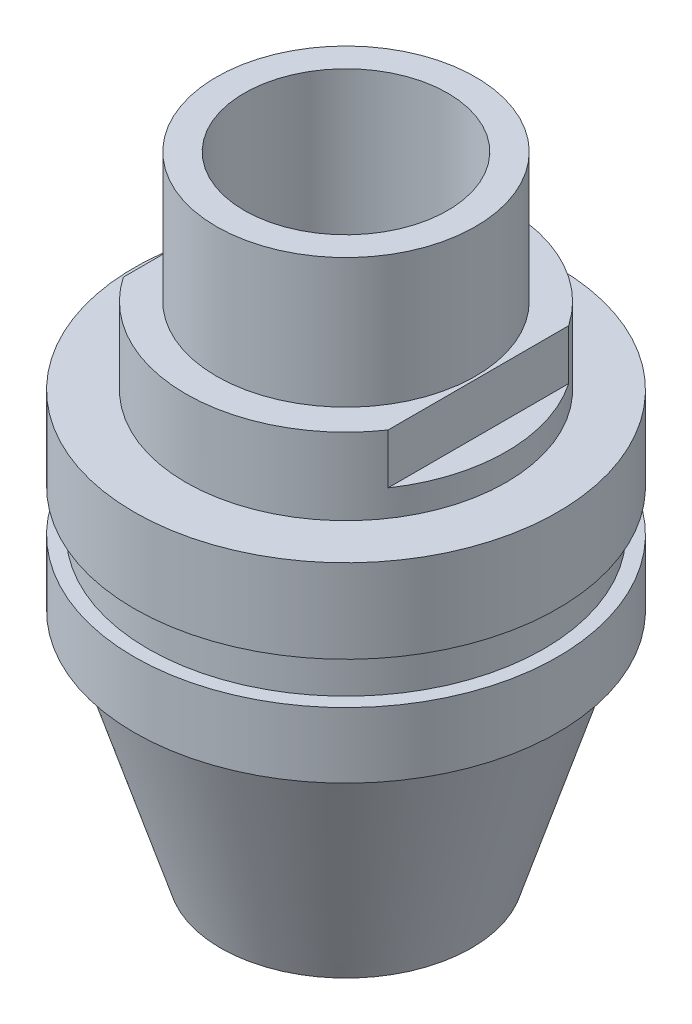
ISO-10303-21;
HEADER;
FILE_DESCRIPTION(('STEP AP214'),'2;1');
FILE_NAME('part.step','',(''),(''),'','','');
FILE_SCHEMA(('AUTOMOTIVE_DESIGN { 1 0 10303 214 1 1 1 1 }'));
ENDSEC;
DATA;
#1=APPLICATION_CONTEXT('core data for automotive mechanical design processes');
#2=APPLICATION_PROTOCOL_DEFINITION('international standard','automotive_design',2000,#1);
#3=PRODUCT_CONTEXT('',#1,'mechanical');
#4=PRODUCT('Part','Part','',(#3));
#5=PRODUCT_RELATED_PRODUCT_CATEGORY('part','',(#4));
#6=PRODUCT_DEFINITION_FORMATION('','',#4);
#7=PRODUCT_DEFINITION_CONTEXT('part definition',#1,'design');
#8=PRODUCT_DEFINITION('design','',#6,#7);
#9=PRODUCT_DEFINITION_SHAPE('','',#8);
#10=(LENGTH_UNIT() NAMED_UNIT(*) SI_UNIT(.MILLI.,.METRE.));
#11=(NAMED_UNIT(*) PLANE_ANGLE_UNIT() SI_UNIT($,.RADIAN.));
#12=(NAMED_UNIT(*) SI_UNIT($,.STERADIAN.) SOLID_ANGLE_UNIT());
#13=UNCERTAINTY_MEASURE_WITH_UNIT(LENGTH_MEASURE(1.E-05),#10,'distance_accuracy_value','');
#14=(GEOMETRIC_REPRESENTATION_CONTEXT(3) GLOBAL_UNCERTAINTY_ASSIGNED_CONTEXT((#13)) GLOBAL_UNIT_ASSIGNED_CONTEXT((#10,
#11,#12)) REPRESENTATION_CONTEXT('',''));
#15=CARTESIAN_POINT('',(0.,0.,0.));
#16=DIRECTION('',(0.,0.,1.));
#17=DIRECTION('',(1.,0.,0.));
#18=AXIS2_PLACEMENT_3D('',#15,#16,#17);
#19=CARTESIAN_POINT('',(0.,0.,0.));
#20=DIRECTION('',(0.,-1.,0.));
#21=DIRECTION('',(0.,0.,-1.));
#22=AXIS2_PLACEMENT_3D('',#19,#20,#21);
#23=PLANE('',#22);
#24=CARTESIAN_POINT('',(0.,0.,0.));
#25=DIRECTION('',(0.,1.,0.));
#26=DIRECTION('',(0.,0.,1.));
#27=AXIS2_PLACEMENT_3D('',#24,#25,#26);
#28=CIRCLE('',#27,4.65);
#29=CARTESIAN_POINT('',(0.,0.,4.65));
#30=VERTEX_POINT('',#29);
#31=EDGE_CURVE('E11',#30,#30,#28,.T.);
#32=ORIENTED_EDGE('',*,*,#31,.T.);
#33=EDGE_LOOP('',(#32));
#34=FACE_BOUND('',#33,.T.);
#35=CARTESIAN_POINT('',(0.,0.,0.));
#36=DIRECTION('',(0.,-1.,0.));
#37=DIRECTION('',(0.,0.,-1.));
#38=AXIS2_PLACEMENT_3D('',#35,#36,#37);
#39=CIRCLE('',#38,3.65);
#40=CARTESIAN_POINT('',(0.,0.,-3.65));
#41=VERTEX_POINT('',#40);
#42=EDGE_CURVE('E128',#41,#41,#39,.F.);
#43=ORIENTED_EDGE('',*,*,#42,.F.);
#44=EDGE_LOOP('',(#43));
#45=FACE_BOUND('',#44,.T.);
#46=ADVANCED_FACE('F33',(#34,#45),#23,.F.);
#47=CARTESIAN_POINT('',(4.65,-4.65,0.));
#48=DIRECTION('',(0.,-1.,0.));
#49=DIRECTION('',(0.,0.,-1.));
#50=AXIS2_PLACEMENT_3D('',#47,#48,#49);
#51=PLANE('',#50);
#52=CARTESIAN_POINT('',(0.,-4.65,0.));
#53=DIRECTION('',(0.,1.,0.));
#54=DIRECTION('',(0.,0.,1.));
#55=AXIS2_PLACEMENT_3D('',#52,#53,#54);
#56=CIRCLE('',#55,4.65);
#57=CARTESIAN_POINT('',(0.,-4.65,4.65));
#58=VERTEX_POINT('',#57);
#59=EDGE_CURVE('E41',#58,#58,#56,.T.);
#60=ORIENTED_EDGE('',*,*,#59,.F.);
#61=EDGE_LOOP('',(#60));
#62=FACE_BOUND('',#61,.T.);
#63=CARTESIAN_POINT('',(0.,-4.65,0.));
#64=DIRECTION('',(0.,1.,0.));
#65=DIRECTION('',(0.,0.,1.));
#66=AXIS2_PLACEMENT_3D('',#63,#64,#65);
#67=CIRCLE('',#66,5.75);
#68=CARTESIAN_POINT('',(-4.75,-4.65,3.24037034920393));
#69=VERTEX_POINT('',#68);
#70=CARTESIAN_POINT('',(4.75,-4.65,3.24037034920393));
#71=VERTEX_POINT('',#70);
#72=EDGE_CURVE('E220',#69,#71,#67,.T.);
#73=ORIENTED_EDGE('',*,*,#72,.T.);
#74=DIRECTION('',(0.,0.,1.));
#75=VECTOR('',#74,1.);
#76=CARTESIAN_POINT('',(4.75,-4.65,0.));
#77=LINE('',#76,#75);
#78=CARTESIAN_POINT('',(4.75,-4.65,-3.24037034920393));
#79=VERTEX_POINT('',#78);
#80=EDGE_CURVE('E171',#79,#71,#77,.T.);
#81=ORIENTED_EDGE('',*,*,#80,.F.);
#82=CARTESIAN_POINT('',(-4.75,-4.65,-3.24037034920393));
#83=VERTEX_POINT('',#82);
#84=EDGE_CURVE('E219',#79,#83,#67,.T.);
#85=ORIENTED_EDGE('',*,*,#84,.T.);
#86=DIRECTION('',(0.,0.,1.));
#87=VECTOR('',#86,1.);
#88=CARTESIAN_POINT('',(-4.75,-4.65,0.));
#89=LINE('',#88,#87);
#90=EDGE_CURVE('E180',#83,#69,#89,.T.);
#91=ORIENTED_EDGE('',*,*,#90,.T.);
#92=EDGE_LOOP('',(#73,#81,#85,#91));
#93=FACE_BOUND('',#92,.T.);
#94=ADVANCED_FACE('F228',(#62,#93),#51,.F.);
#95=CARTESIAN_POINT('',(0.,0.,0.));
#96=DIRECTION('',(0.,1.,0.));
#97=DIRECTION('',(0.,0.,1.));
#98=AXIS2_PLACEMENT_3D('',#95,#96,#97);
#99=CYLINDRICAL_SURFACE('',#98,5.75);
#100=CARTESIAN_POINT('',(0.,-7.4,0.));
#101=DIRECTION('',(0.,1.,0.));
#102=DIRECTION('',(0.,0.,1.));
#103=AXIS2_PLACEMENT_3D('',#100,#101,#102);
#104=CIRCLE('',#103,5.75);
#105=CARTESIAN_POINT('',(0.,-7.4,5.75));
#106=VERTEX_POINT('',#105);
#107=EDGE_CURVE('E216',#106,#106,#104,.T.);
#108=ORIENTED_EDGE('',*,*,#107,.T.);
#109=EDGE_LOOP('',(#108));
#110=FACE_BOUND('',#109,.T.);
#111=CARTESIAN_POINT('',(0.,-6.45,0.));
#112=DIRECTION('',(0.,1.,0.));
#113=DIRECTION('',(0.,0.,1.));
#114=AXIS2_PLACEMENT_3D('',#111,#112,#113);
#115=CIRCLE('',#114,5.75);
#116=CARTESIAN_POINT('',(4.75,-6.45,3.24037034920393));
#117=VERTEX_POINT('',#116);
#118=CARTESIAN_POINT('',(4.75,-6.45,-3.24037034920393));
#119=VERTEX_POINT('',#118);
#120=EDGE_CURVE('E172',#117,#119,#115,.T.);
#121=ORIENTED_EDGE('',*,*,#120,.F.);
#122=DIRECTION('',(0.,1.,0.));
#123=VECTOR('',#122,1.);
#124=CARTESIAN_POINT('',(4.75,-6.45,3.24037034920393));
#125=LINE('',#124,#123);
#126=EDGE_CURVE('E177',#117,#71,#125,.T.);
#127=ORIENTED_EDGE('',*,*,#126,.T.);
#128=ORIENTED_EDGE('',*,*,#72,.F.);
#129=DIRECTION('',(0.,1.,0.));
#130=VECTOR('',#129,1.);
#131=CARTESIAN_POINT('',(-4.75,-6.45,3.24037034920393));
#132=LINE('',#131,#130);
#133=CARTESIAN_POINT('',(-4.75,-6.45,3.24037034920393));
#134=VERTEX_POINT('',#133);
#135=EDGE_CURVE('E188',#134,#69,#132,.T.);
#136=ORIENTED_EDGE('',*,*,#135,.F.);
#137=CARTESIAN_POINT('',(0.,-6.45,0.));
#138=DIRECTION('',(0.,1.,0.));
#139=DIRECTION('',(0.,0.,1.));
#140=AXIS2_PLACEMENT_3D('',#137,#138,#139);
#141=CIRCLE('',#140,5.75);
#142=CARTESIAN_POINT('',(-4.75,-6.45,-3.24037034920393));
#143=VERTEX_POINT('',#142);
#144=EDGE_CURVE('E183',#143,#134,#141,.T.);
#145=ORIENTED_EDGE('',*,*,#144,.F.);
#146=DIRECTION('',(0.,1.,0.));
#147=VECTOR('',#146,1.);
#148=CARTESIAN_POINT('',(-4.75,-6.45,-3.24037034920393));
#149=LINE('',#148,#147);
#150=EDGE_CURVE('E185',#143,#83,#149,.T.);
#151=ORIENTED_EDGE('',*,*,#150,.T.);
#152=ORIENTED_EDGE('',*,*,#84,.F.);
#153=DIRECTION('',(0.,1.,0.));
#154=VECTOR('',#153,1.);
#155=CARTESIAN_POINT('',(4.75,-6.45,-3.24037034920393));
#156=LINE('',#155,#154);
#157=EDGE_CURVE('E175',#119,#79,#156,.T.);
#158=ORIENTED_EDGE('',*,*,#157,.F.);
#159=EDGE_LOOP('',(#121,#127,#128,#136,#145,#151,#152,#158));
#160=FACE_BOUND('',#159,.T.);
#161=ADVANCED_FACE('F231',(#110,#160),#99,.T.);
#162=CARTESIAN_POINT('',(0.,0.,0.));
#163=DIRECTION('',(0.,1.,0.));
#164=DIRECTION('',(0.,0.,1.));
#165=AXIS2_PLACEMENT_3D('',#162,#163,#164);
#166=CYLINDRICAL_SURFACE('',#165,4.65);
#167=ORIENTED_EDGE('',*,*,#31,.F.);
#168=EDGE_LOOP('',(#167));
#169=FACE_BOUND('',#168,.T.);
#170=ORIENTED_EDGE('',*,*,#59,.T.);
#171=EDGE_LOOP('',(#170));
#172=FACE_BOUND('',#171,.T.);
#173=ADVANCED_FACE('F226',(#169,#172),#166,.T.);
#174=CARTESIAN_POINT('',(5.75,-7.4,0.));
#175=DIRECTION('',(0.,-1.,0.));
#176=DIRECTION('',(0.,0.,-1.));
#177=AXIS2_PLACEMENT_3D('',#174,#175,#176);
#178=PLANE('',#177);
#179=ORIENTED_EDGE('',*,*,#107,.F.);
#180=EDGE_LOOP('',(#179));
#181=FACE_BOUND('',#180,.T.);
#182=CARTESIAN_POINT('',(0.,-7.4,0.));
#183=DIRECTION('',(0.,1.,0.));
#184=DIRECTION('',(0.,0.,1.));
#185=AXIS2_PLACEMENT_3D('',#182,#183,#184);
#186=CIRCLE('',#185,7.6);
#187=CARTESIAN_POINT('',(0.,-7.4,7.6));
#188=VERTEX_POINT('',#187);
#189=EDGE_CURVE('E213',#188,#188,#186,.T.);
#190=ORIENTED_EDGE('',*,*,#189,.T.);
#191=EDGE_LOOP('',(#190));
#192=FACE_BOUND('',#191,.T.);
#193=ADVANCED_FACE('F379',(#181,#192),#178,.F.);
#194=CARTESIAN_POINT('',(0.,0.,0.));
#195=DIRECTION('',(0.,1.,0.));
#196=DIRECTION('',(0.,0.,1.));
#197=AXIS2_PLACEMENT_3D('',#194,#195,#196);
#198=CYLINDRICAL_SURFACE('',#197,7.6);
#199=ORIENTED_EDGE('',*,*,#189,.F.);
#200=EDGE_LOOP('',(#199));
#201=FACE_BOUND('',#200,.T.);
#202=CARTESIAN_POINT('',(0.,-10.4,0.));
#203=DIRECTION('',(0.,1.,0.));
#204=DIRECTION('',(0.,0.,1.));
#205=AXIS2_PLACEMENT_3D('',#202,#203,#204);
#206=CIRCLE('',#205,7.6);
#207=CARTESIAN_POINT('',(0.,-10.4,7.6));
#208=VERTEX_POINT('',#207);
#209=EDGE_CURVE('E210',#208,#208,#206,.T.);
#210=ORIENTED_EDGE('',*,*,#209,.T.);
#211=EDGE_LOOP('',(#210));
#212=FACE_BOUND('',#211,.T.);
#213=ADVANCED_FACE('F375',(#201,#212),#198,.T.);
#214=CARTESIAN_POINT('',(7.6,-10.4,0.));
#215=DIRECTION('',(0.,1.,0.));
#216=DIRECTION('',(0.,0.,1.));
#217=AXIS2_PLACEMENT_3D('',#214,#215,#216);
#218=PLANE('',#217);
#219=ORIENTED_EDGE('',*,*,#209,.F.);
#220=EDGE_LOOP('',(#219));
#221=FACE_BOUND('',#220,.T.);
#222=CARTESIAN_POINT('',(0.,-10.4,0.));
#223=DIRECTION('',(0.,1.,0.));
#224=DIRECTION('',(0.,0.,1.));
#225=AXIS2_PLACEMENT_3D('',#222,#223,#224);
#226=CIRCLE('',#225,7.1);
#227=CARTESIAN_POINT('',(0.,-10.4,7.1));
#228=VERTEX_POINT('',#227);
#229=EDGE_CURVE('E207',#228,#228,#226,.T.);
#230=ORIENTED_EDGE('',*,*,#229,.T.);
#231=EDGE_LOOP('',(#230));
#232=FACE_BOUND('',#231,.T.);
#233=ADVANCED_FACE('F371',(#221,#232),#218,.F.);
#234=CARTESIAN_POINT('',(0.,0.,0.));
#235=DIRECTION('',(0.,1.,0.));
#236=DIRECTION('',(0.,0.,1.));
#237=AXIS2_PLACEMENT_3D('',#234,#235,#236);
#238=CYLINDRICAL_SURFACE('',#237,7.1);
#239=ORIENTED_EDGE('',*,*,#229,.F.);
#240=EDGE_LOOP('',(#239));
#241=FACE_BOUND('',#240,.T.);
#242=CARTESIAN_POINT('',(0.,-11.9,0.));
#243=DIRECTION('',(0.,1.,0.));
#244=DIRECTION('',(0.,0.,1.));
#245=AXIS2_PLACEMENT_3D('',#242,#243,#244);
#246=CIRCLE('',#245,7.1);
#247=CARTESIAN_POINT('',(0.,-11.9,7.1));
#248=VERTEX_POINT('',#247);
#249=EDGE_CURVE('E204',#248,#248,#246,.T.);
#250=ORIENTED_EDGE('',*,*,#249,.T.);
#251=EDGE_LOOP('',(#250));
#252=FACE_BOUND('',#251,.T.);
#253=ADVANCED_FACE('F367',(#241,#252),#238,.T.);
#254=CARTESIAN_POINT('',(7.1,-11.9,0.));
#255=DIRECTION('',(0.,-1.,0.));
#256=DIRECTION('',(0.,0.,-1.));
#257=AXIS2_PLACEMENT_3D('',#254,#255,#256);
#258=PLANE('',#257);
#259=ORIENTED_EDGE('',*,*,#249,.F.);
#260=EDGE_LOOP('',(#259));
#261=FACE_BOUND('',#260,.T.);
#262=CARTESIAN_POINT('',(0.,-11.9,0.));
#263=DIRECTION('',(0.,1.,0.));
#264=DIRECTION('',(0.,0.,1.));
#265=AXIS2_PLACEMENT_3D('',#262,#263,#264);
#266=CIRCLE('',#265,7.6);
#267=CARTESIAN_POINT('',(0.,-11.9,7.6));
#268=VERTEX_POINT('',#267);
#269=EDGE_CURVE('E201',#268,#268,#266,.T.);
#270=ORIENTED_EDGE('',*,*,#269,.T.);
#271=EDGE_LOOP('',(#270));
#272=FACE_BOUND('',#271,.T.);
#273=ADVANCED_FACE('F363',(#261,#272),#258,.F.);
#274=CARTESIAN_POINT('',(0.,0.,0.));
#275=DIRECTION('',(0.,1.,0.));
#276=DIRECTION('',(0.,0.,1.));
#277=AXIS2_PLACEMENT_3D('',#274,#275,#276);
#278=CYLINDRICAL_SURFACE('',#277,7.6);
#279=ORIENTED_EDGE('',*,*,#269,.F.);
#280=EDGE_LOOP('',(#279));
#281=FACE_BOUND('',#280,.T.);
#282=CARTESIAN_POINT('',(0.,-14.25,0.));
#283=DIRECTION('',(0.,1.,0.));
#284=DIRECTION('',(0.,0.,1.));
#285=AXIS2_PLACEMENT_3D('',#282,#283,#284);
#286=CIRCLE('',#285,7.6);
#287=CARTESIAN_POINT('',(0.,-14.25,7.6));
#288=VERTEX_POINT('',#287);
#289=EDGE_CURVE('E198',#288,#288,#286,.T.);
#290=ORIENTED_EDGE('',*,*,#289,.T.);
#291=EDGE_LOOP('',(#290));
#292=FACE_BOUND('',#291,.T.);
#293=ADVANCED_FACE('F356',(#281,#292),#278,.T.);
#294=CARTESIAN_POINT('',(7.6,-14.25,0.));
#295=DIRECTION('',(0.,1.,0.));
#296=DIRECTION('',(0.,0.,1.));
#297=AXIS2_PLACEMENT_3D('',#294,#295,#296);
#298=PLANE('',#297);
#299=ORIENTED_EDGE('',*,*,#289,.F.);
#300=EDGE_LOOP('',(#299));
#301=FACE_BOUND('',#300,.T.);
#302=CARTESIAN_POINT('',(0.,-14.25,0.));
#303=DIRECTION('',(0.,1.,0.));
#304=DIRECTION('',(0.,0.,1.));
#305=AXIS2_PLACEMENT_3D('',#302,#303,#304);
#306=CIRCLE('',#305,7.1);
#307=CARTESIAN_POINT('',(0.,-14.25,7.1));
#308=VERTEX_POINT('',#307);
#309=EDGE_CURVE('E195',#308,#308,#306,.T.);
#310=ORIENTED_EDGE('',*,*,#309,.T.);
#311=EDGE_LOOP('',(#310));
#312=FACE_BOUND('',#311,.T.);
#313=ADVANCED_FACE('F350',(#301,#312),#298,.F.);
#314=CARTESIAN_POINT('',(0.,-22.5,0.));
#315=DIRECTION('',(0.,1.,0.));
#316=DIRECTION('',(0.,0.,1.));
#317=AXIS2_PLACEMENT_3D('',#314,#315,#316);
#318=CONICAL_SURFACE('',#317,4.5,0.30529865679053);
#319=ORIENTED_EDGE('',*,*,#309,.F.);
#320=EDGE_LOOP('',(#319));
#321=FACE_BOUND('',#320,.T.);
#322=CARTESIAN_POINT('',(0.,-22.5,0.));
#323=DIRECTION('',(0.,1.,0.));
#324=DIRECTION('',(0.,0.,1.));
#325=AXIS2_PLACEMENT_3D('',#322,#323,#324);
#326=CIRCLE('',#325,4.5);
#327=CARTESIAN_POINT('',(0.,-22.5,4.5));
#328=VERTEX_POINT('',#327);
#329=EDGE_CURVE('E190',#328,#328,#326,.T.);
#330=ORIENTED_EDGE('',*,*,#329,.T.);
#331=EDGE_LOOP('',(#330));
#332=FACE_BOUND('',#331,.T.);
#333=ADVANCED_FACE('F345',(#321,#332),#318,.T.);
#334=CARTESIAN_POINT('',(4.5,-22.5,0.));
#335=DIRECTION('',(0.,1.,0.));
#336=DIRECTION('',(0.,0.,1.));
#337=AXIS2_PLACEMENT_3D('',#334,#335,#336);
#338=PLANE('',#337);
#339=CARTESIAN_POINT('',(0.,-22.5,0.));
#340=DIRECTION('',(0.,1.,0.));
#341=DIRECTION('',(0.,0.,1.));
#342=AXIS2_PLACEMENT_3D('',#339,#340,#341);
#343=CIRCLE('',#342,3.76666666666667);
#344=CARTESIAN_POINT('',(0.,-22.5,3.76666666666667));
#345=VERTEX_POINT('',#344);
#346=EDGE_CURVE('E36',#345,#345,#343,.T.);
#347=ORIENTED_EDGE('',*,*,#346,.T.);
#348=EDGE_LOOP('',(#347));
#349=FACE_BOUND('',#348,.T.);
#350=ORIENTED_EDGE('',*,*,#329,.F.);
#351=EDGE_LOOP('',(#350));
#352=FACE_BOUND('',#351,.T.);
#353=ADVANCED_FACE('F255',(#349,#352),#338,.F.);
#354=CARTESIAN_POINT('',(-4.75,-6.45,0.));
#355=DIRECTION('',(-1.,0.,0.));
#356=DIRECTION('',(0.,0.,1.));
#357=AXIS2_PLACEMENT_3D('',#354,#355,#356);
#358=PLANE('',#357);
#359=ORIENTED_EDGE('',*,*,#90,.F.);
#360=ORIENTED_EDGE('',*,*,#150,.F.);
#361=DIRECTION('',(0.,0.,1.));
#362=VECTOR('',#361,1.);
#363=CARTESIAN_POINT('',(-4.75,-6.45,0.));
#364=LINE('',#363,#362);
#365=EDGE_CURVE('E54',#143,#134,#364,.T.);
#366=ORIENTED_EDGE('',*,*,#365,.T.);
#367=ORIENTED_EDGE('',*,*,#135,.T.);
#368=EDGE_LOOP('',(#359,#360,#366,#367));
#369=FACE_BOUND('',#368,.T.);
#370=ADVANCED_FACE('F245',(#369),#358,.T.);
#371=CARTESIAN_POINT('',(0.,-6.45,0.));
#372=DIRECTION('',(0.,1.,0.));
#373=DIRECTION('',(0.,0.,1.));
#374=AXIS2_PLACEMENT_3D('',#371,#372,#373);
#375=PLANE('',#374);
#376=ORIENTED_EDGE('',*,*,#365,.F.);
#377=ORIENTED_EDGE('',*,*,#144,.T.);
#378=EDGE_LOOP('',(#376,#377));
#379=FACE_BOUND('',#378,.T.);
#380=ADVANCED_FACE('F246',(#379),#375,.T.);
#381=CARTESIAN_POINT('',(4.75,-6.45,0.));
#382=DIRECTION('',(-1.,0.,0.));
#383=DIRECTION('',(0.,0.,1.));
#384=AXIS2_PLACEMENT_3D('',#381,#382,#383);
#385=PLANE('',#384);
#386=ORIENTED_EDGE('',*,*,#80,.T.);
#387=ORIENTED_EDGE('',*,*,#126,.F.);
#388=DIRECTION('',(0.,0.,1.));
#389=VECTOR('',#388,1.);
#390=CARTESIAN_POINT('',(4.75,-6.45,0.));
#391=LINE('',#390,#389);
#392=EDGE_CURVE('E47',#119,#117,#391,.T.);
#393=ORIENTED_EDGE('',*,*,#392,.F.);
#394=ORIENTED_EDGE('',*,*,#157,.T.);
#395=EDGE_LOOP('',(#386,#387,#393,#394));
#396=FACE_BOUND('',#395,.T.);
#397=ADVANCED_FACE('F243',(#396),#385,.F.);
#398=CARTESIAN_POINT('',(0.,-6.45,0.));
#399=DIRECTION('',(0.,1.,0.));
#400=DIRECTION('',(0.,0.,1.));
#401=AXIS2_PLACEMENT_3D('',#398,#399,#400);
#402=PLANE('',#401);
#403=ORIENTED_EDGE('',*,*,#120,.T.);
#404=ORIENTED_EDGE('',*,*,#392,.T.);
#405=EDGE_LOOP('',(#403,#404));
#406=FACE_BOUND('',#405,.T.);
#407=ADVANCED_FACE('F253',(#406),#402,.T.);
#408=CARTESIAN_POINT('',(4.65,-5.65,0.));
#409=DIRECTION('',(0.,-1.,0.));
#410=DIRECTION('',(0.,0.,-1.));
#411=AXIS2_PLACEMENT_3D('',#408,#409,#410);
#412=PLANE('',#411);
#413=CARTESIAN_POINT('',(0.,-5.65,0.));
#414=DIRECTION('',(0.,-1.,0.));
#415=DIRECTION('',(0.,0.,-1.));
#416=AXIS2_PLACEMENT_3D('',#413,#414,#415);
#417=CIRCLE('',#416,3.65);
#418=CARTESIAN_POINT('',(0.,-5.65,-3.65));
#419=VERTEX_POINT('',#418);
#420=EDGE_CURVE('E125',#419,#419,#417,.F.);
#421=ORIENTED_EDGE('',*,*,#420,.T.);
#422=EDGE_LOOP('',(#421));
#423=FACE_BOUND('',#422,.T.);
#424=CARTESIAN_POINT('',(0.,-5.65,0.));
#425=DIRECTION('',(0.,-1.,0.));
#426=DIRECTION('',(0.,0.,-1.));
#427=AXIS2_PLACEMENT_3D('',#424,#425,#426);
#428=CIRCLE('',#427,4.75);
#429=CARTESIAN_POINT('',(-3.75,-5.65,2.91547594742265));
#430=VERTEX_POINT('',#429);
#431=CARTESIAN_POINT('',(3.75,-5.65,2.91547594742265));
#432=VERTEX_POINT('',#431);
#433=EDGE_CURVE('E104',#430,#432,#428,.F.);
#434=ORIENTED_EDGE('',*,*,#433,.F.);
#435=DIRECTION('',(0.,0.,1.));
#436=VECTOR('',#435,1.);
#437=CARTESIAN_POINT('',(-3.75,-5.65,0.));
#438=LINE('',#437,#436);
#439=CARTESIAN_POINT('',(-3.75,-5.65,-2.91547594742265));
#440=VERTEX_POINT('',#439);
#441=EDGE_CURVE('E117',#440,#430,#438,.T.);
#442=ORIENTED_EDGE('',*,*,#441,.F.);
#443=CARTESIAN_POINT('',(0.,-5.65,0.));
#444=DIRECTION('',(0.,-1.,0.));
#445=DIRECTION('',(0.,0.,-1.));
#446=AXIS2_PLACEMENT_3D('',#443,#444,#445);
#447=CIRCLE('',#446,4.75);
#448=CARTESIAN_POINT('',(3.75,-5.65,-2.91547594742265));
#449=VERTEX_POINT('',#448);
#450=EDGE_CURVE('E105',#449,#440,#447,.F.);
#451=ORIENTED_EDGE('',*,*,#450,.F.);
#452=DIRECTION('',(0.,0.,1.));
#453=VECTOR('',#452,1.);
#454=CARTESIAN_POINT('',(3.75,-5.65,0.));
#455=LINE('',#454,#453);
#456=EDGE_CURVE('E99',#449,#432,#455,.T.);
#457=ORIENTED_EDGE('',*,*,#456,.T.);
#458=EDGE_LOOP('',(#434,#442,#451,#457));
#459=FACE_BOUND('',#458,.T.);
#460=ADVANCED_FACE('F101',(#423,#459),#412,.T.);
#461=CARTESIAN_POINT('',(0.,0.,0.));
#462=DIRECTION('',(0.,1.,0.));
#463=DIRECTION('',(0.,0.,1.));
#464=AXIS2_PLACEMENT_3D('',#461,#462,#463);
#465=CYLINDRICAL_SURFACE('',#464,4.75);
#466=CARTESIAN_POINT('',(0.,-8.4,0.));
#467=DIRECTION('',(0.,-1.,0.));
#468=DIRECTION('',(0.,0.,-1.));
#469=AXIS2_PLACEMENT_3D('',#466,#467,#468);
#470=CIRCLE('',#469,4.75);
#471=CARTESIAN_POINT('',(0.,-8.4,-4.75));
#472=VERTEX_POINT('',#471);
#473=EDGE_CURVE('E130',#472,#472,#470,.F.);
#474=ORIENTED_EDGE('',*,*,#473,.F.);
#475=EDGE_LOOP('',(#474));
#476=FACE_BOUND('',#475,.T.);
#477=CARTESIAN_POINT('',(0.,-7.45,0.));
#478=DIRECTION('',(0.,1.,0.));
#479=DIRECTION('',(0.,0.,1.));
#480=AXIS2_PLACEMENT_3D('',#477,#478,#479);
#481=CIRCLE('',#480,4.75);
#482=CARTESIAN_POINT('',(3.75,-7.45,2.91547594742265));
#483=VERTEX_POINT('',#482);
#484=CARTESIAN_POINT('',(3.75,-7.45,-2.91547594742265));
#485=VERTEX_POINT('',#484);
#486=EDGE_CURVE('E108',#483,#485,#481,.T.);
#487=ORIENTED_EDGE('',*,*,#486,.T.);
#488=DIRECTION('',(0.,1.,0.));
#489=VECTOR('',#488,1.);
#490=CARTESIAN_POINT('',(3.75,-7.45,-2.91547594742265));
#491=LINE('',#490,#489);
#492=EDGE_CURVE('E118',#485,#449,#491,.T.);
#493=ORIENTED_EDGE('',*,*,#492,.T.);
#494=ORIENTED_EDGE('',*,*,#450,.T.);
#495=DIRECTION('',(0.,1.,0.));
#496=VECTOR('',#495,1.);
#497=CARTESIAN_POINT('',(-3.75,-7.45,-2.91547594742265));
#498=LINE('',#497,#496);
#499=CARTESIAN_POINT('',(-3.75,-7.45,-2.91547594742265));
#500=VERTEX_POINT('',#499);
#501=EDGE_CURVE('E142',#500,#440,#498,.T.);
#502=ORIENTED_EDGE('',*,*,#501,.F.);
#503=CARTESIAN_POINT('',(0.,-7.45,0.));
#504=DIRECTION('',(0.,1.,0.));
#505=DIRECTION('',(0.,0.,1.));
#506=AXIS2_PLACEMENT_3D('',#503,#504,#505);
#507=CIRCLE('',#506,4.75);
#508=CARTESIAN_POINT('',(-3.75,-7.45,2.91547594742265));
#509=VERTEX_POINT('',#508);
#510=EDGE_CURVE('E143',#500,#509,#507,.T.);
#511=ORIENTED_EDGE('',*,*,#510,.T.);
#512=DIRECTION('',(0.,1.,0.));
#513=VECTOR('',#512,1.);
#514=CARTESIAN_POINT('',(-3.75,-7.45,2.91547594742265));
#515=LINE('',#514,#513);
#516=EDGE_CURVE('E123',#509,#430,#515,.T.);
#517=ORIENTED_EDGE('',*,*,#516,.T.);
#518=ORIENTED_EDGE('',*,*,#433,.T.);
#519=DIRECTION('',(0.,1.,0.));
#520=VECTOR('',#519,1.);
#521=CARTESIAN_POINT('',(3.75,-7.45,2.91547594742265));
#522=LINE('',#521,#520);
#523=EDGE_CURVE('E111',#483,#432,#522,.T.);
#524=ORIENTED_EDGE('',*,*,#523,.F.);
#525=EDGE_LOOP('',(#487,#493,#494,#502,#511,#517,#518,#524));
#526=FACE_BOUND('',#525,.T.);
#527=ADVANCED_FACE('F120',(#476,#526),#465,.F.);
#528=CARTESIAN_POINT('',(0.,0.,0.));
#529=DIRECTION('',(0.,1.,0.));
#530=DIRECTION('',(0.,0.,1.));
#531=AXIS2_PLACEMENT_3D('',#528,#529,#530);
#532=CYLINDRICAL_SURFACE('',#531,3.65);
#533=ORIENTED_EDGE('',*,*,#42,.T.);
#534=EDGE_LOOP('',(#533));
#535=FACE_BOUND('',#534,.T.);
#536=ORIENTED_EDGE('',*,*,#420,.F.);
#537=EDGE_LOOP('',(#536));
#538=FACE_BOUND('',#537,.T.);
#539=ADVANCED_FACE('F265',(#535,#538),#532,.F.);
#540=CARTESIAN_POINT('',(5.75,-8.4,0.));
#541=DIRECTION('',(0.,-1.,0.));
#542=DIRECTION('',(0.,0.,-1.));
#543=AXIS2_PLACEMENT_3D('',#540,#541,#542);
#544=PLANE('',#543);
#545=ORIENTED_EDGE('',*,*,#473,.T.);
#546=EDGE_LOOP('',(#545));
#547=FACE_BOUND('',#546,.T.);
#548=CARTESIAN_POINT('',(0.,-8.4,0.));
#549=DIRECTION('',(0.,-1.,0.));
#550=DIRECTION('',(0.,0.,-1.));
#551=AXIS2_PLACEMENT_3D('',#548,#549,#550);
#552=CIRCLE('',#551,6.6);
#553=CARTESIAN_POINT('',(0.,-8.4,-6.6));
#554=VERTEX_POINT('',#553);
#555=EDGE_CURVE('E138',#554,#554,#552,.F.);
#556=ORIENTED_EDGE('',*,*,#555,.F.);
#557=EDGE_LOOP('',(#556));
#558=FACE_BOUND('',#557,.T.);
#559=ADVANCED_FACE('F268',(#547,#558),#544,.T.);
#560=CARTESIAN_POINT('',(0.,0.,0.));
#561=DIRECTION('',(0.,1.,0.));
#562=DIRECTION('',(0.,0.,1.));
#563=AXIS2_PLACEMENT_3D('',#560,#561,#562);
#564=CYLINDRICAL_SURFACE('',#563,6.6);
#565=ORIENTED_EDGE('',*,*,#555,.T.);
#566=EDGE_LOOP('',(#565));
#567=FACE_BOUND('',#566,.T.);
#568=CARTESIAN_POINT('',(0.,-9.4,0.));
#569=DIRECTION('',(0.,1.,0.));
#570=DIRECTION('',(0.,0.,1.));
#571=AXIS2_PLACEMENT_3D('',#568,#569,#570);
#572=CIRCLE('',#571,6.6);
#573=CARTESIAN_POINT('',(0.,-9.4,6.6));
#574=VERTEX_POINT('',#573);
#575=EDGE_CURVE('E150',#574,#574,#572,.T.);
#576=ORIENTED_EDGE('',*,*,#575,.F.);
#577=EDGE_LOOP('',(#576));
#578=FACE_BOUND('',#577,.T.);
#579=ADVANCED_FACE('F286',(#567,#578),#564,.F.);
#580=CARTESIAN_POINT('',(7.6,-9.4,0.));
#581=DIRECTION('',(0.,1.,0.));
#582=DIRECTION('',(0.,0.,1.));
#583=AXIS2_PLACEMENT_3D('',#580,#581,#582);
#584=PLANE('',#583);
#585=ORIENTED_EDGE('',*,*,#575,.T.);
#586=EDGE_LOOP('',(#585));
#587=FACE_BOUND('',#586,.T.);
#588=CARTESIAN_POINT('',(0.,-9.4,0.));
#589=DIRECTION('',(0.,1.,0.));
#590=DIRECTION('',(0.,0.,1.));
#591=AXIS2_PLACEMENT_3D('',#588,#589,#590);
#592=CIRCLE('',#591,6.1);
#593=CARTESIAN_POINT('',(0.,-9.4,6.1));
#594=VERTEX_POINT('',#593);
#595=EDGE_CURVE('E153',#594,#594,#592,.T.);
#596=ORIENTED_EDGE('',*,*,#595,.F.);
#597=EDGE_LOOP('',(#596));
#598=FACE_BOUND('',#597,.T.);
#599=ADVANCED_FACE('F290',(#587,#598),#584,.T.);
#600=CARTESIAN_POINT('',(0.,0.,0.));
#601=DIRECTION('',(0.,1.,0.));
#602=DIRECTION('',(0.,0.,1.));
#603=AXIS2_PLACEMENT_3D('',#600,#601,#602);
#604=CYLINDRICAL_SURFACE('',#603,6.1);
#605=ORIENTED_EDGE('',*,*,#595,.T.);
#606=EDGE_LOOP('',(#605));
#607=FACE_BOUND('',#606,.T.);
#608=CARTESIAN_POINT('',(0.,-12.9,0.));
#609=DIRECTION('',(0.,-1.,0.));
#610=DIRECTION('',(0.,0.,-1.));
#611=AXIS2_PLACEMENT_3D('',#608,#609,#610);
#612=CIRCLE('',#611,6.1);
#613=CARTESIAN_POINT('',(0.,-12.9,-6.1));
#614=VERTEX_POINT('',#613);
#615=EDGE_CURVE('E156',#614,#614,#612,.F.);
#616=ORIENTED_EDGE('',*,*,#615,.F.);
#617=EDGE_LOOP('',(#616));
#618=FACE_BOUND('',#617,.T.);
#619=ADVANCED_FACE('F294',(#607,#618),#604,.F.);
#620=CARTESIAN_POINT('',(7.1,-12.9,0.));
#621=DIRECTION('',(0.,-1.,0.));
#622=DIRECTION('',(0.,0.,-1.));
#623=AXIS2_PLACEMENT_3D('',#620,#621,#622);
#624=PLANE('',#623);
#625=ORIENTED_EDGE('',*,*,#615,.T.);
#626=EDGE_LOOP('',(#625));
#627=FACE_BOUND('',#626,.T.);
#628=CARTESIAN_POINT('',(0.,-12.9,0.));
#629=DIRECTION('',(0.,-1.,0.));
#630=DIRECTION('',(0.,0.,-1.));
#631=AXIS2_PLACEMENT_3D('',#628,#629,#630);
#632=CIRCLE('',#631,6.6);
#633=CARTESIAN_POINT('',(0.,-12.9,-6.6));
#634=VERTEX_POINT('',#633);
#635=EDGE_CURVE('E159',#634,#634,#632,.F.);
#636=ORIENTED_EDGE('',*,*,#635,.F.);
#637=EDGE_LOOP('',(#636));
#638=FACE_BOUND('',#637,.T.);
#639=ADVANCED_FACE('F298',(#627,#638),#624,.T.);
#640=CARTESIAN_POINT('',(0.,0.,0.));
#641=DIRECTION('',(0.,1.,0.));
#642=DIRECTION('',(0.,0.,1.));
#643=AXIS2_PLACEMENT_3D('',#640,#641,#642);
#644=CYLINDRICAL_SURFACE('',#643,6.6);
#645=ORIENTED_EDGE('',*,*,#635,.T.);
#646=EDGE_LOOP('',(#645));
#647=FACE_BOUND('',#646,.T.);
#648=CARTESIAN_POINT('',(0.,-13.25,0.));
#649=DIRECTION('',(0.,1.,0.));
#650=DIRECTION('',(0.,0.,1.));
#651=AXIS2_PLACEMENT_3D('',#648,#649,#650);
#652=CIRCLE('',#651,6.6);
#653=CARTESIAN_POINT('',(0.,-13.25,6.6));
#654=VERTEX_POINT('',#653);
#655=EDGE_CURVE('E162',#654,#654,#652,.T.);
#656=ORIENTED_EDGE('',*,*,#655,.F.);
#657=EDGE_LOOP('',(#656));
#658=FACE_BOUND('',#657,.T.);
#659=ADVANCED_FACE('F302',(#647,#658),#644,.F.);
#660=CARTESIAN_POINT('',(7.6,-13.25,0.));
#661=DIRECTION('',(0.,1.,0.));
#662=DIRECTION('',(0.,0.,1.));
#663=AXIS2_PLACEMENT_3D('',#660,#661,#662);
#664=PLANE('',#663);
#665=ORIENTED_EDGE('',*,*,#655,.T.);
#666=EDGE_LOOP('',(#665));
#667=FACE_BOUND('',#666,.T.);
#668=CARTESIAN_POINT('',(0.,-13.25,0.));
#669=DIRECTION('',(0.,1.,0.));
#670=DIRECTION('',(0.,0.,1.));
#671=AXIS2_PLACEMENT_3D('',#668,#669,#670);
#672=CIRCLE('',#671,6.36666666666667);
#673=CARTESIAN_POINT('',(0.,-13.25,6.36666666666667));
#674=VERTEX_POINT('',#673);
#675=EDGE_CURVE('E141',#674,#674,#672,.T.);
#676=ORIENTED_EDGE('',*,*,#675,.F.);
#677=EDGE_LOOP('',(#676));
#678=FACE_BOUND('',#677,.T.);
#679=ADVANCED_FACE('F306',(#667,#678),#664,.T.);
#680=CARTESIAN_POINT('',(0.,-22.1994219653179,0.));
#681=DIRECTION('',(0.,1.,0.));
#682=DIRECTION('',(0.,0.,1.));
#683=AXIS2_PLACEMENT_3D('',#680,#681,#682);
#684=CONICAL_SURFACE('',#683,3.54624277456648,0.30529865679053);
#685=ORIENTED_EDGE('',*,*,#675,.T.);
#686=EDGE_LOOP('',(#685));
#687=FACE_BOUND('',#686,.T.);
#688=CARTESIAN_POINT('',(0.,-21.5,0.));
#689=DIRECTION('',(0.,1.,0.));
#690=DIRECTION('',(0.,0.,1.));
#691=AXIS2_PLACEMENT_3D('',#688,#689,#690);
#692=CIRCLE('',#691,3.76666666666667);
#693=CARTESIAN_POINT('',(0.,-21.5,3.76666666666667));
#694=VERTEX_POINT('',#693);
#695=EDGE_CURVE('E339',#694,#694,#692,.T.);
#696=ORIENTED_EDGE('',*,*,#695,.F.);
#697=EDGE_LOOP('',(#696));
#698=FACE_BOUND('',#697,.T.);
#699=ADVANCED_FACE('F310',(#687,#698),#684,.F.);
#700=CARTESIAN_POINT('',(-3.75,-6.45,0.));
#701=DIRECTION('',(-1.,0.,0.));
#702=DIRECTION('',(0.,0.,1.));
#703=AXIS2_PLACEMENT_3D('',#700,#701,#702);
#704=PLANE('',#703);
#705=ORIENTED_EDGE('',*,*,#441,.T.);
#706=ORIENTED_EDGE('',*,*,#516,.F.);
#707=DIRECTION('',(0.,0.,1.));
#708=VECTOR('',#707,1.);
#709=CARTESIAN_POINT('',(-3.75,-7.45,0.));
#710=LINE('',#709,#708);
#711=EDGE_CURVE('E135',#500,#509,#710,.T.);
#712=ORIENTED_EDGE('',*,*,#711,.F.);
#713=ORIENTED_EDGE('',*,*,#501,.T.);
#714=EDGE_LOOP('',(#705,#706,#712,#713));
#715=FACE_BOUND('',#714,.T.);
#716=ADVANCED_FACE('F314',(#715),#704,.F.);
#717=CARTESIAN_POINT('',(0.,-7.45,0.));
#718=DIRECTION('',(0.,1.,0.));
#719=DIRECTION('',(0.,0.,1.));
#720=AXIS2_PLACEMENT_3D('',#717,#718,#719);
#721=PLANE('',#720);
#722=ORIENTED_EDGE('',*,*,#711,.T.);
#723=ORIENTED_EDGE('',*,*,#510,.F.);
#724=EDGE_LOOP('',(#722,#723));
#725=FACE_BOUND('',#724,.T.);
#726=ADVANCED_FACE('F318',(#725),#721,.F.);
#727=CARTESIAN_POINT('',(3.75,-6.45,0.));
#728=DIRECTION('',(-1.,0.,0.));
#729=DIRECTION('',(0.,0.,1.));
#730=AXIS2_PLACEMENT_3D('',#727,#728,#729);
#731=PLANE('',#730);
#732=ORIENTED_EDGE('',*,*,#456,.F.);
#733=ORIENTED_EDGE('',*,*,#492,.F.);
#734=DIRECTION('',(0.,0.,1.));
#735=VECTOR('',#734,1.);
#736=CARTESIAN_POINT('',(3.75,-7.45,0.));
#737=LINE('',#736,#735);
#738=EDGE_CURVE('E114',#485,#483,#737,.T.);
#739=ORIENTED_EDGE('',*,*,#738,.T.);
#740=ORIENTED_EDGE('',*,*,#523,.T.);
#741=EDGE_LOOP('',(#732,#733,#739,#740));
#742=FACE_BOUND('',#741,.T.);
#743=ADVANCED_FACE('F112',(#742),#731,.T.);
#744=CARTESIAN_POINT('',(0.,-7.45,0.));
#745=DIRECTION('',(0.,1.,0.));
#746=DIRECTION('',(0.,0.,1.));
#747=AXIS2_PLACEMENT_3D('',#744,#745,#746);
#748=PLANE('',#747);
#749=ORIENTED_EDGE('',*,*,#486,.F.);
#750=ORIENTED_EDGE('',*,*,#738,.F.);
#751=EDGE_LOOP('',(#749,#750));
#752=FACE_BOUND('',#751,.T.);
#753=ADVANCED_FACE('F325',(#752),#748,.F.);
#754=CARTESIAN_POINT('',(0.,-28.3,0.));
#755=DIRECTION('',(0.,1.,0.));
#756=DIRECTION('',(0.,0.,1.));
#757=AXIS2_PLACEMENT_3D('',#754,#755,#756);
#758=CYLINDRICAL_SURFACE('',#757,3.76666666666667);
#759=ORIENTED_EDGE('',*,*,#695,.T.);
#760=EDGE_LOOP('',(#759));
#761=FACE_BOUND('',#760,.T.);
#762=ORIENTED_EDGE('',*,*,#346,.F.);
#763=EDGE_LOOP('',(#762));
#764=FACE_BOUND('',#763,.T.);
#765=ADVANCED_FACE('F282',(#761,#764),#758,.F.);
#766=CLOSED_SHELL('',(#46,#94,#161,#173,#193,#213,#233,#253,#273,#293,#313,#333,#353,#370,#380,
#397,#407,#460,#527,#539,#559,#579,#599,#619,#639,#659,#679,#699,#716,#726,#743,#753,#765));
#767=MANIFOLD_SOLID_BREP('B2',#766);
#768=ADVANCED_BREP_SHAPE_REPRESENTATION('',(#18,#767),#14);
#769=SHAPE_DEFINITION_REPRESENTATION(#9,#768);
ENDSEC;
END-ISO-10303-21;
